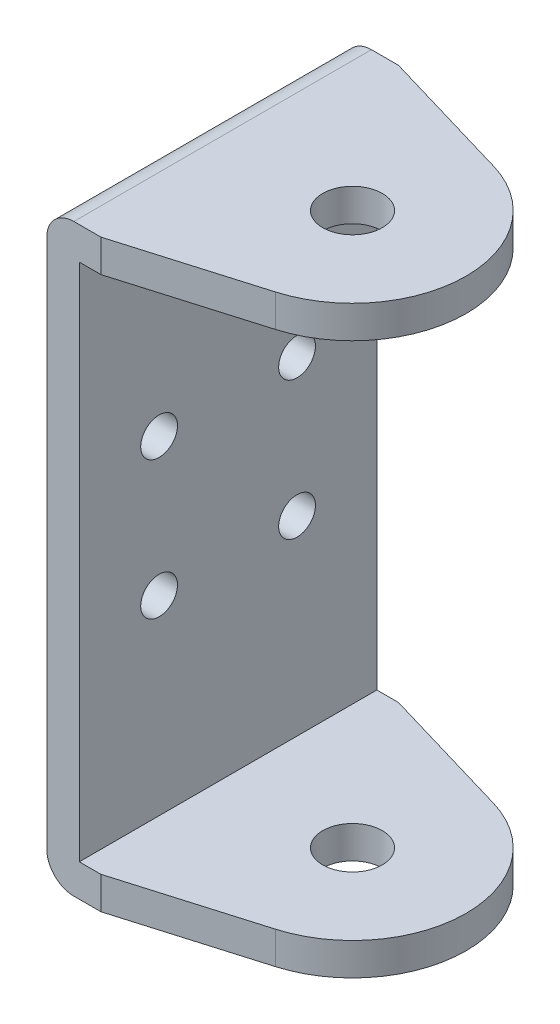
ISO-10303-21;
HEADER;
FILE_DESCRIPTION(('STEP AP214'),'2;1');
FILE_NAME('part.step','',(''),(''),'','','');
FILE_SCHEMA(('AUTOMOTIVE_DESIGN { 1 0 10303 214 1 1 1 1 }'));
ENDSEC;
DATA;
#1=APPLICATION_CONTEXT('core data for automotive mechanical design processes');
#2=APPLICATION_PROTOCOL_DEFINITION('international standard','automotive_design',2000,#1);
#3=PRODUCT_CONTEXT('',#1,'mechanical');
#4=PRODUCT('Part','Part','',(#3));
#5=PRODUCT_RELATED_PRODUCT_CATEGORY('part','',(#4));
#6=PRODUCT_DEFINITION_FORMATION('','',#4);
#7=PRODUCT_DEFINITION_CONTEXT('part definition',#1,'design');
#8=PRODUCT_DEFINITION('design','',#6,#7);
#9=PRODUCT_DEFINITION_SHAPE('','',#8);
#10=(LENGTH_UNIT() NAMED_UNIT(*) SI_UNIT(.MILLI.,.METRE.));
#11=(NAMED_UNIT(*) PLANE_ANGLE_UNIT() SI_UNIT($,.RADIAN.));
#12=(NAMED_UNIT(*) SI_UNIT($,.STERADIAN.) SOLID_ANGLE_UNIT());
#13=UNCERTAINTY_MEASURE_WITH_UNIT(LENGTH_MEASURE(1.E-05),#10,'distance_accuracy_value','');
#14=(GEOMETRIC_REPRESENTATION_CONTEXT(3) GLOBAL_UNCERTAINTY_ASSIGNED_CONTEXT((#13)) GLOBAL_UNIT_ASSIGNED_CONTEXT((#10,
#11,#12)) REPRESENTATION_CONTEXT('',''));
#15=CARTESIAN_POINT('',(0.,0.,0.));
#16=DIRECTION('',(0.,0.,1.));
#17=DIRECTION('',(1.,0.,0.));
#18=AXIS2_PLACEMENT_3D('',#15,#16,#17);
#19=CARTESIAN_POINT('',(-44.,48.,27.5));
#20=DIRECTION('',(-1.,0.,0.));
#21=DIRECTION('',(0.,-1.,0.));
#22=AXIS2_PLACEMENT_3D('',#19,#20,#21);
#23=PLANE('',#22);
#24=CARTESIAN_POINT('',(-44.,-12.75,12.75));
#25=DIRECTION('',(-1.,0.,0.));
#26=DIRECTION('',(0.,-1.,0.));
#27=AXIS2_PLACEMENT_3D('',#24,#25,#26);
#28=CIRCLE('',#27,3.4);
#29=CARTESIAN_POINT('',(-44.,-16.15,12.75));
#30=VERTEX_POINT('',#29);
#31=EDGE_CURVE('E210',#30,#30,#28,.T.);
#32=ORIENTED_EDGE('',*,*,#31,.T.);
#33=EDGE_LOOP('',(#32));
#34=FACE_BOUND('',#33,.T.);
#35=CARTESIAN_POINT('',(-44.,-12.75,-12.75));
#36=DIRECTION('',(-1.,0.,0.));
#37=DIRECTION('',(0.,-1.,0.));
#38=AXIS2_PLACEMENT_3D('',#35,#36,#37);
#39=CIRCLE('',#38,3.4);
#40=CARTESIAN_POINT('',(-44.,-16.15,-12.75));
#41=VERTEX_POINT('',#40);
#42=EDGE_CURVE('E216',#41,#41,#39,.T.);
#43=ORIENTED_EDGE('',*,*,#42,.T.);
#44=EDGE_LOOP('',(#43));
#45=FACE_BOUND('',#44,.T.);
#46=CARTESIAN_POINT('',(-44.,12.75,-12.75));
#47=DIRECTION('',(-1.,0.,0.));
#48=DIRECTION('',(0.,-1.,0.));
#49=AXIS2_PLACEMENT_3D('',#46,#47,#48);
#50=CIRCLE('',#49,3.4);
#51=CARTESIAN_POINT('',(-44.,9.34999999999999,-12.75));
#52=VERTEX_POINT('',#51);
#53=EDGE_CURVE('E222',#52,#52,#50,.T.);
#54=ORIENTED_EDGE('',*,*,#53,.T.);
#55=EDGE_LOOP('',(#54));
#56=FACE_BOUND('',#55,.T.);
#57=CARTESIAN_POINT('',(-44.,12.75,12.75));
#58=DIRECTION('',(-1.,0.,0.));
#59=DIRECTION('',(0.,-1.,0.));
#60=AXIS2_PLACEMENT_3D('',#57,#58,#59);
#61=CIRCLE('',#60,3.4);
#62=CARTESIAN_POINT('',(-44.,9.35,12.75));
#63=VERTEX_POINT('',#62);
#64=EDGE_CURVE('E228',#63,#63,#61,.T.);
#65=ORIENTED_EDGE('',*,*,#64,.T.);
#66=EDGE_LOOP('',(#65));
#67=FACE_BOUND('',#66,.T.);
#68=DIRECTION('',(0.,1.,0.));
#69=VECTOR('',#68,1.);
#70=CARTESIAN_POINT('',(-44.,48.,-27.5));
#71=LINE('',#70,#69);
#72=CARTESIAN_POINT('',(-44.,-48.,-27.5));
#73=VERTEX_POINT('',#72);
#74=CARTESIAN_POINT('',(-44.,48.,-27.5));
#75=VERTEX_POINT('',#74);
#76=EDGE_CURVE('E231',#73,#75,#71,.T.);
#77=ORIENTED_EDGE('',*,*,#76,.T.);
#78=DIRECTION('',(0.,0.,-1.));
#79=VECTOR('',#78,1.);
#80=CARTESIAN_POINT('',(-44.,48.,27.5));
#81=LINE('',#80,#79);
#82=CARTESIAN_POINT('',(-44.,48.,27.5));
#83=VERTEX_POINT('',#82);
#84=EDGE_CURVE('E157',#83,#75,#81,.T.);
#85=ORIENTED_EDGE('',*,*,#84,.F.);
#86=DIRECTION('',(0.,1.,0.));
#87=VECTOR('',#86,1.);
#88=CARTESIAN_POINT('',(-44.,48.,27.5));
#89=LINE('',#88,#87);
#90=CARTESIAN_POINT('',(-44.,-48.,27.5));
#91=VERTEX_POINT('',#90);
#92=EDGE_CURVE('E232',#91,#83,#89,.T.);
#93=ORIENTED_EDGE('',*,*,#92,.F.);
#94=DIRECTION('',(0.,0.,-1.));
#95=VECTOR('',#94,1.);
#96=CARTESIAN_POINT('',(-44.,-48.,27.5));
#97=LINE('',#96,#95);
#98=EDGE_CURVE('E187',#91,#73,#97,.T.);
#99=ORIENTED_EDGE('',*,*,#98,.T.);
#100=EDGE_LOOP('',(#77,#85,#93,#99));
#101=FACE_BOUND('',#100,.T.);
#102=ADVANCED_FACE('F35',(#34,#45,#56,#67,#101),#23,.F.);
#103=CARTESIAN_POINT('',(0.,48.,27.5));
#104=DIRECTION('',(0.,1.,0.));
#105=DIRECTION('',(-1.,0.,0.));
#106=AXIS2_PLACEMENT_3D('',#103,#104,#105);
#107=PLANE('',#106);
#108=CARTESIAN_POINT('',(-21.,48.,0.));
#109=DIRECTION('',(0.,1.,0.));
#110=DIRECTION('',(-1.,0.,0.));
#111=AXIS2_PLACEMENT_3D('',#108,#109,#110);
#112=CIRCLE('',#111,5.5);
#113=CARTESIAN_POINT('',(-26.5,48.,0.));
#114=VERTEX_POINT('',#113);
#115=EDGE_CURVE('E283',#114,#114,#112,.T.);
#116=ORIENTED_EDGE('',*,*,#115,.T.);
#117=EDGE_LOOP('',(#116));
#118=FACE_BOUND('',#117,.T.);
#119=DIRECTION('',(1.,0.,0.));
#120=VECTOR('',#119,1.);
#121=CARTESIAN_POINT('',(0.,48.,-27.5));
#122=LINE('',#121,#120);
#123=CARTESIAN_POINT('',(-40.,48.,-27.5));
#124=VERTEX_POINT('',#123);
#125=EDGE_CURVE('E143',#75,#124,#122,.T.);
#126=ORIENTED_EDGE('',*,*,#125,.T.);
#127=DIRECTION('',(0.95913299414629,0.,0.282955649422261));
#128=VECTOR('',#127,1.);
#129=CARTESIAN_POINT('',(11.724009476655,48.,-12.2408015556622));
#130=LINE('',#129,#128);
#131=CARTESIAN_POINT('',(-15.0579313621325,48.,-20.1417928770721));
#132=VERTEX_POINT('',#131);
#133=EDGE_CURVE('E50',#124,#132,#130,.T.);
#134=ORIENTED_EDGE('',*,*,#133,.T.);
#135=CARTESIAN_POINT('',(-21.,48.,0.));
#136=DIRECTION('',(0.,1.,0.));
#137=DIRECTION('',(-1.,0.,0.));
#138=AXIS2_PLACEMENT_3D('',#135,#136,#137);
#139=CIRCLE('',#138,21.);
#140=CARTESIAN_POINT('',(-15.0579313621325,48.,20.1417928770721));
#141=VERTEX_POINT('',#140);
#142=EDGE_CURVE('E54',#132,#141,#139,.F.);
#143=ORIENTED_EDGE('',*,*,#142,.T.);
#144=DIRECTION('',(-0.95913299414629,0.,0.282955649422261));
#145=VECTOR('',#144,1.);
#146=CARTESIAN_POINT('',(-3.20255598159894,48.,16.6443160303607));
#147=LINE('',#146,#145);
#148=CARTESIAN_POINT('',(-40.,48.,27.5));
#149=VERTEX_POINT('',#148);
#150=EDGE_CURVE('E201',#141,#149,#147,.T.);
#151=ORIENTED_EDGE('',*,*,#150,.T.);
#152=DIRECTION('',(1.,0.,0.));
#153=VECTOR('',#152,1.);
#154=CARTESIAN_POINT('',(0.,48.,27.5));
#155=LINE('',#154,#153);
#156=EDGE_CURVE('E234',#83,#149,#155,.T.);
#157=ORIENTED_EDGE('',*,*,#156,.F.);
#158=ORIENTED_EDGE('',*,*,#84,.T.);
#159=EDGE_LOOP('',(#126,#134,#143,#151,#157,#158));
#160=FACE_BOUND('',#159,.T.);
#161=ADVANCED_FACE('F304',(#118,#160),#107,.F.);
#162=CARTESIAN_POINT('',(0.,54.,27.5));
#163=DIRECTION('',(0.,-1.,0.));
#164=DIRECTION('',(1.,0.,0.));
#165=AXIS2_PLACEMENT_3D('',#162,#163,#164);
#166=PLANE('',#165);
#167=CARTESIAN_POINT('',(-21.,54.,0.));
#168=DIRECTION('',(0.,1.,0.));
#169=DIRECTION('',(-1.,0.,0.));
#170=AXIS2_PLACEMENT_3D('',#167,#168,#169);
#171=CIRCLE('',#170,5.5);
#172=CARTESIAN_POINT('',(-26.5,54.,0.));
#173=VERTEX_POINT('',#172);
#174=EDGE_CURVE('E370',#173,#173,#171,.T.);
#175=ORIENTED_EDGE('',*,*,#174,.F.);
#176=EDGE_LOOP('',(#175));
#177=FACE_BOUND('',#176,.T.);
#178=CARTESIAN_POINT('',(-21.,54.,0.));
#179=DIRECTION('',(0.,-1.,0.));
#180=DIRECTION('',(1.,0.,0.));
#181=AXIS2_PLACEMENT_3D('',#178,#179,#180);
#182=CIRCLE('',#181,21.);
#183=CARTESIAN_POINT('',(-15.0579313621325,54.,20.1417928770721));
#184=VERTEX_POINT('',#183);
#185=CARTESIAN_POINT('',(-15.0579313621325,54.,-20.1417928770721));
#186=VERTEX_POINT('',#185);
#187=EDGE_CURVE('E149',#184,#186,#182,.F.);
#188=ORIENTED_EDGE('',*,*,#187,.T.);
#189=DIRECTION('',(-0.95913299414629,0.,-0.282955649422261));
#190=VECTOR('',#189,1.);
#191=CARTESIAN_POINT('',(11.724009476655,54.,-12.2408015556622));
#192=LINE('',#191,#190);
#193=CARTESIAN_POINT('',(-40.,54.,-27.5));
#194=VERTEX_POINT('',#193);
#195=EDGE_CURVE('E146',#186,#194,#192,.T.);
#196=ORIENTED_EDGE('',*,*,#195,.T.);
#197=DIRECTION('',(-1.,0.,0.));
#198=VECTOR('',#197,1.);
#199=CARTESIAN_POINT('',(0.,54.,-27.5));
#200=LINE('',#199,#198);
#201=CARTESIAN_POINT('',(-45.,54.,-27.5));
#202=VERTEX_POINT('',#201);
#203=EDGE_CURVE('E133',#194,#202,#200,.T.);
#204=ORIENTED_EDGE('',*,*,#203,.T.);
#205=DIRECTION('',(0.,0.,-1.));
#206=VECTOR('',#205,1.);
#207=CARTESIAN_POINT('',(-45.,54.,27.5));
#208=LINE('',#207,#206);
#209=CARTESIAN_POINT('',(-45.,54.,27.5));
#210=VERTEX_POINT('',#209);
#211=EDGE_CURVE('E162',#210,#202,#208,.T.);
#212=ORIENTED_EDGE('',*,*,#211,.F.);
#213=DIRECTION('',(-1.,0.,0.));
#214=VECTOR('',#213,1.);
#215=CARTESIAN_POINT('',(0.,54.,27.5));
#216=LINE('',#215,#214);
#217=CARTESIAN_POINT('',(-40.,54.,27.5));
#218=VERTEX_POINT('',#217);
#219=EDGE_CURVE('E237',#218,#210,#216,.T.);
#220=ORIENTED_EDGE('',*,*,#219,.F.);
#221=DIRECTION('',(0.95913299414629,0.,-0.282955649422261));
#222=VECTOR('',#221,1.);
#223=CARTESIAN_POINT('',(-3.20255598159894,54.,16.6443160303607));
#224=LINE('',#223,#222);
#225=EDGE_CURVE('E196',#218,#184,#224,.T.);
#226=ORIENTED_EDGE('',*,*,#225,.T.);
#227=EDGE_LOOP('',(#188,#196,#204,#212,#220,#226));
#228=FACE_BOUND('',#227,.T.);
#229=ADVANCED_FACE('F147',(#177,#228),#166,.F.);
#230=CARTESIAN_POINT('',(-45.,49.,27.5));
#231=DIRECTION('',(0.,0.,-1.));
#232=DIRECTION('',(-1.,0.,0.));
#233=AXIS2_PLACEMENT_3D('',#230,#231,#232);
#234=CYLINDRICAL_SURFACE('',#233,5.);
#235=CARTESIAN_POINT('',(-45.,49.,-27.5));
#236=DIRECTION('',(0.,0.,1.));
#237=DIRECTION('',(-1.,0.,0.));
#238=AXIS2_PLACEMENT_3D('',#235,#236,#237);
#239=CIRCLE('',#238,5.);
#240=CARTESIAN_POINT('',(-50.,49.,-27.5));
#241=VERTEX_POINT('',#240);
#242=EDGE_CURVE('E139',#202,#241,#239,.T.);
#243=ORIENTED_EDGE('',*,*,#242,.T.);
#244=DIRECTION('',(0.,0.,-1.));
#245=VECTOR('',#244,1.);
#246=CARTESIAN_POINT('',(-50.,49.,27.5));
#247=LINE('',#246,#245);
#248=CARTESIAN_POINT('',(-50.,49.,27.5));
#249=VERTEX_POINT('',#248);
#250=EDGE_CURVE('E265',#249,#241,#247,.T.);
#251=ORIENTED_EDGE('',*,*,#250,.F.);
#252=CARTESIAN_POINT('',(-45.,49.,27.5));
#253=DIRECTION('',(0.,0.,1.));
#254=DIRECTION('',(-1.,0.,0.));
#255=AXIS2_PLACEMENT_3D('',#252,#253,#254);
#256=CIRCLE('',#255,5.);
#257=EDGE_CURVE('E239',#210,#249,#256,.T.);
#258=ORIENTED_EDGE('',*,*,#257,.F.);
#259=ORIENTED_EDGE('',*,*,#211,.T.);
#260=EDGE_LOOP('',(#243,#251,#258,#259));
#261=FACE_BOUND('',#260,.T.);
#262=ADVANCED_FACE('F269',(#261),#234,.T.);
#263=CARTESIAN_POINT('',(-50.,49.,27.5));
#264=DIRECTION('',(1.,0.,0.));
#265=DIRECTION('',(0.,1.,0.));
#266=AXIS2_PLACEMENT_3D('',#263,#264,#265);
#267=PLANE('',#266);
#268=CARTESIAN_POINT('',(-50.,-12.75,12.75));
#269=DIRECTION('',(-1.,0.,0.));
#270=DIRECTION('',(0.,1.,0.));
#271=AXIS2_PLACEMENT_3D('',#268,#269,#270);
#272=CIRCLE('',#271,3.4);
#273=CARTESIAN_POINT('',(-50.,-9.35000000000001,12.75));
#274=VERTEX_POINT('',#273);
#275=EDGE_CURVE('E207',#274,#274,#272,.T.);
#276=ORIENTED_EDGE('',*,*,#275,.F.);
#277=EDGE_LOOP('',(#276));
#278=FACE_BOUND('',#277,.T.);
#279=CARTESIAN_POINT('',(-50.,-12.75,-12.75));
#280=DIRECTION('',(-1.,0.,0.));
#281=DIRECTION('',(0.,1.,0.));
#282=AXIS2_PLACEMENT_3D('',#279,#280,#281);
#283=CIRCLE('',#282,3.4);
#284=CARTESIAN_POINT('',(-50.,-9.35000000000001,-12.75));
#285=VERTEX_POINT('',#284);
#286=EDGE_CURVE('E213',#285,#285,#283,.T.);
#287=ORIENTED_EDGE('',*,*,#286,.F.);
#288=EDGE_LOOP('',(#287));
#289=FACE_BOUND('',#288,.T.);
#290=CARTESIAN_POINT('',(-50.,12.75,-12.75));
#291=DIRECTION('',(-1.,0.,0.));
#292=DIRECTION('',(0.,-1.,0.));
#293=AXIS2_PLACEMENT_3D('',#290,#291,#292);
#294=CIRCLE('',#293,3.4);
#295=CARTESIAN_POINT('',(-50.,9.34999999999999,-12.75));
#296=VERTEX_POINT('',#295);
#297=EDGE_CURVE('E219',#296,#296,#294,.T.);
#298=ORIENTED_EDGE('',*,*,#297,.F.);
#299=EDGE_LOOP('',(#298));
#300=FACE_BOUND('',#299,.T.);
#301=CARTESIAN_POINT('',(-50.,12.75,12.75));
#302=DIRECTION('',(-1.,0.,0.));
#303=DIRECTION('',(0.,-1.,0.));
#304=AXIS2_PLACEMENT_3D('',#301,#302,#303);
#305=CIRCLE('',#304,3.4);
#306=CARTESIAN_POINT('',(-50.,9.35,12.75));
#307=VERTEX_POINT('',#306);
#308=EDGE_CURVE('E225',#307,#307,#305,.T.);
#309=ORIENTED_EDGE('',*,*,#308,.F.);
#310=EDGE_LOOP('',(#309));
#311=FACE_BOUND('',#310,.T.);
#312=DIRECTION('',(0.,-1.,0.));
#313=VECTOR('',#312,1.);
#314=CARTESIAN_POINT('',(-50.,49.,-27.5));
#315=LINE('',#314,#313);
#316=CARTESIAN_POINT('',(-50.,-49.,-27.5));
#317=VERTEX_POINT('',#316);
#318=EDGE_CURVE('E250',#241,#317,#315,.T.);
#319=ORIENTED_EDGE('',*,*,#318,.T.);
#320=DIRECTION('',(0.,0.,-1.));
#321=VECTOR('',#320,1.);
#322=CARTESIAN_POINT('',(-50.,-49.,27.5));
#323=LINE('',#322,#321);
#324=CARTESIAN_POINT('',(-50.,-49.,27.5));
#325=VERTEX_POINT('',#324);
#326=EDGE_CURVE('E262',#325,#317,#323,.T.);
#327=ORIENTED_EDGE('',*,*,#326,.F.);
#328=DIRECTION('',(0.,-1.,0.));
#329=VECTOR('',#328,1.);
#330=CARTESIAN_POINT('',(-50.,49.,27.5));
#331=LINE('',#330,#329);
#332=EDGE_CURVE('E241',#249,#325,#331,.T.);
#333=ORIENTED_EDGE('',*,*,#332,.F.);
#334=ORIENTED_EDGE('',*,*,#250,.T.);
#335=EDGE_LOOP('',(#319,#327,#333,#334));
#336=FACE_BOUND('',#335,.T.);
#337=ADVANCED_FACE('F318',(#278,#289,#300,#311,#336),#267,.F.);
#338=CARTESIAN_POINT('',(-45.,-49.,27.5));
#339=DIRECTION('',(0.,0.,-1.));
#340=DIRECTION('',(-1.,0.,0.));
#341=AXIS2_PLACEMENT_3D('',#338,#339,#340);
#342=CYLINDRICAL_SURFACE('',#341,5.);
#343=CARTESIAN_POINT('',(-45.,-49.,-27.5));
#344=DIRECTION('',(0.,0.,1.));
#345=DIRECTION('',(-1.,0.,0.));
#346=AXIS2_PLACEMENT_3D('',#343,#344,#345);
#347=CIRCLE('',#346,5.);
#348=CARTESIAN_POINT('',(-45.,-54.,-27.5));
#349=VERTEX_POINT('',#348);
#350=EDGE_CURVE('E252',#317,#349,#347,.T.);
#351=ORIENTED_EDGE('',*,*,#350,.T.);
#352=DIRECTION('',(0.,0.,-1.));
#353=VECTOR('',#352,1.);
#354=CARTESIAN_POINT('',(-45.,-54.,27.5));
#355=LINE('',#354,#353);
#356=CARTESIAN_POINT('',(-45.,-54.,27.5));
#357=VERTEX_POINT('',#356);
#358=EDGE_CURVE('E259',#357,#349,#355,.T.);
#359=ORIENTED_EDGE('',*,*,#358,.F.);
#360=CARTESIAN_POINT('',(-45.,-49.,27.5));
#361=DIRECTION('',(0.,0.,1.));
#362=DIRECTION('',(-1.,0.,0.));
#363=AXIS2_PLACEMENT_3D('',#360,#361,#362);
#364=CIRCLE('',#363,5.);
#365=EDGE_CURVE('E243',#325,#357,#364,.T.);
#366=ORIENTED_EDGE('',*,*,#365,.F.);
#367=ORIENTED_EDGE('',*,*,#326,.T.);
#368=EDGE_LOOP('',(#351,#359,#366,#367));
#369=FACE_BOUND('',#368,.T.);
#370=ADVANCED_FACE('F321',(#369),#342,.T.);
#371=CARTESIAN_POINT('',(0.,-54.,27.5));
#372=DIRECTION('',(0.,1.,0.));
#373=DIRECTION('',(-1.,0.,0.));
#374=AXIS2_PLACEMENT_3D('',#371,#372,#373);
#375=PLANE('',#374);
#376=CARTESIAN_POINT('',(-21.,-54.,0.));
#377=DIRECTION('',(0.,1.,0.));
#378=DIRECTION('',(-1.,0.,0.));
#379=AXIS2_PLACEMENT_3D('',#376,#377,#378);
#380=CIRCLE('',#379,5.5);
#381=CARTESIAN_POINT('',(-26.5,-54.,0.));
#382=VERTEX_POINT('',#381);
#383=EDGE_CURVE('E373',#382,#382,#380,.F.);
#384=ORIENTED_EDGE('',*,*,#383,.F.);
#385=EDGE_LOOP('',(#384));
#386=FACE_BOUND('',#385,.T.);
#387=DIRECTION('',(1.,0.,0.));
#388=VECTOR('',#387,1.);
#389=CARTESIAN_POINT('',(0.,-54.,-27.5));
#390=LINE('',#389,#388);
#391=CARTESIAN_POINT('',(-40.,-54.,-27.5));
#392=VERTEX_POINT('',#391);
#393=EDGE_CURVE('E254',#349,#392,#390,.T.);
#394=ORIENTED_EDGE('',*,*,#393,.T.);
#395=DIRECTION('',(0.95913299414629,0.,0.282955649422261));
#396=VECTOR('',#395,1.);
#397=CARTESIAN_POINT('',(11.724009476655,-54.,-12.2408015556622));
#398=LINE('',#397,#396);
#399=CARTESIAN_POINT('',(-15.0579313621325,-54.,-20.1417928770721));
#400=VERTEX_POINT('',#399);
#401=EDGE_CURVE('E153',#392,#400,#398,.T.);
#402=ORIENTED_EDGE('',*,*,#401,.T.);
#403=CARTESIAN_POINT('',(-21.,-54.,0.));
#404=DIRECTION('',(0.,1.,0.));
#405=DIRECTION('',(-1.,0.,0.));
#406=AXIS2_PLACEMENT_3D('',#403,#404,#405);
#407=CIRCLE('',#406,21.);
#408=CARTESIAN_POINT('',(-15.0579313621325,-54.,20.1417928770721));
#409=VERTEX_POINT('',#408);
#410=EDGE_CURVE('E203',#400,#409,#407,.F.);
#411=ORIENTED_EDGE('',*,*,#410,.T.);
#412=DIRECTION('',(-0.95913299414629,0.,0.282955649422261));
#413=VECTOR('',#412,1.);
#414=CARTESIAN_POINT('',(-3.20255598159893,-54.,16.6443160303608));
#415=LINE('',#414,#413);
#416=CARTESIAN_POINT('',(-40.,-54.,27.5));
#417=VERTEX_POINT('',#416);
#418=EDGE_CURVE('E194',#409,#417,#415,.T.);
#419=ORIENTED_EDGE('',*,*,#418,.T.);
#420=DIRECTION('',(1.,0.,0.));
#421=VECTOR('',#420,1.);
#422=CARTESIAN_POINT('',(0.,-54.,27.5));
#423=LINE('',#422,#421);
#424=EDGE_CURVE('E178',#357,#417,#423,.T.);
#425=ORIENTED_EDGE('',*,*,#424,.F.);
#426=ORIENTED_EDGE('',*,*,#358,.T.);
#427=EDGE_LOOP('',(#394,#402,#411,#419,#425,#426));
#428=FACE_BOUND('',#427,.T.);
#429=ADVANCED_FACE('F293',(#386,#428),#375,.F.);
#430=CARTESIAN_POINT('',(0.,-48.,27.5));
#431=DIRECTION('',(0.,-1.,0.));
#432=DIRECTION('',(1.,0.,0.));
#433=AXIS2_PLACEMENT_3D('',#430,#431,#432);
#434=PLANE('',#433);
#435=CARTESIAN_POINT('',(-21.,-48.,0.));
#436=DIRECTION('',(0.,-1.,0.));
#437=DIRECTION('',(1.,0.,0.));
#438=AXIS2_PLACEMENT_3D('',#435,#436,#437);
#439=CIRCLE('',#438,5.5);
#440=CARTESIAN_POINT('',(-15.5,-48.,0.));
#441=VERTEX_POINT('',#440);
#442=EDGE_CURVE('E38',#441,#441,#439,.T.);
#443=ORIENTED_EDGE('',*,*,#442,.T.);
#444=EDGE_LOOP('',(#443));
#445=FACE_BOUND('',#444,.T.);
#446=CARTESIAN_POINT('',(-21.,-48.,0.));
#447=DIRECTION('',(0.,-1.,0.));
#448=DIRECTION('',(1.,0.,0.));
#449=AXIS2_PLACEMENT_3D('',#446,#447,#448);
#450=CIRCLE('',#449,21.);
#451=CARTESIAN_POINT('',(-15.0579313621325,-48.,20.1417928770721));
#452=VERTEX_POINT('',#451);
#453=CARTESIAN_POINT('',(-15.0579313621325,-48.,-20.1417928770721));
#454=VERTEX_POINT('',#453);
#455=EDGE_CURVE('E11',#452,#454,#450,.F.);
#456=ORIENTED_EDGE('',*,*,#455,.T.);
#457=DIRECTION('',(-0.95913299414629,0.,-0.282955649422261));
#458=VECTOR('',#457,1.);
#459=CARTESIAN_POINT('',(11.724009476655,-48.,-12.2408015556622));
#460=LINE('',#459,#458);
#461=CARTESIAN_POINT('',(-40.,-48.,-27.5));
#462=VERTEX_POINT('',#461);
#463=EDGE_CURVE('E287',#454,#462,#460,.T.);
#464=ORIENTED_EDGE('',*,*,#463,.T.);
#465=DIRECTION('',(-1.,0.,0.));
#466=VECTOR('',#465,1.);
#467=CARTESIAN_POINT('',(0.,-48.,-27.5));
#468=LINE('',#467,#466);
#469=EDGE_CURVE('E235',#462,#73,#468,.T.);
#470=ORIENTED_EDGE('',*,*,#469,.T.);
#471=ORIENTED_EDGE('',*,*,#98,.F.);
#472=DIRECTION('',(-1.,0.,0.));
#473=VECTOR('',#472,1.);
#474=CARTESIAN_POINT('',(0.,-48.,27.5));
#475=LINE('',#474,#473);
#476=CARTESIAN_POINT('',(-40.,-48.,27.5));
#477=VERTEX_POINT('',#476);
#478=EDGE_CURVE('E175',#477,#91,#475,.T.);
#479=ORIENTED_EDGE('',*,*,#478,.F.);
#480=DIRECTION('',(0.95913299414629,0.,-0.282955649422261));
#481=VECTOR('',#480,1.);
#482=CARTESIAN_POINT('',(-3.20255598159893,-48.,16.6443160303608));
#483=LINE('',#482,#481);
#484=EDGE_CURVE('E184',#477,#452,#483,.T.);
#485=ORIENTED_EDGE('',*,*,#484,.T.);
#486=EDGE_LOOP('',(#456,#464,#470,#471,#479,#485));
#487=FACE_BOUND('',#486,.T.);
#488=ADVANCED_FACE('F183',(#445,#487),#434,.F.);
#489=CARTESIAN_POINT('',(-45.,-49.,27.5));
#490=DIRECTION('',(0.,0.,-1.));
#491=DIRECTION('',(-1.,0.,0.));
#492=AXIS2_PLACEMENT_3D('',#489,#490,#491);
#493=PLANE('',#492);
#494=ORIENTED_EDGE('',*,*,#424,.T.);
#495=DIRECTION('',(0.,1.,0.));
#496=VECTOR('',#495,1.);
#497=CARTESIAN_POINT('',(-40.,-49.,27.5));
#498=LINE('',#497,#496);
#499=EDGE_CURVE('E43',#417,#477,#498,.T.);
#500=ORIENTED_EDGE('',*,*,#499,.T.);
#501=ORIENTED_EDGE('',*,*,#478,.T.);
#502=ORIENTED_EDGE('',*,*,#92,.T.);
#503=ORIENTED_EDGE('',*,*,#156,.T.);
#504=EDGE_CURVE('E160',#149,#218,#498,.T.);
#505=ORIENTED_EDGE('',*,*,#504,.T.);
#506=ORIENTED_EDGE('',*,*,#219,.T.);
#507=ORIENTED_EDGE('',*,*,#257,.T.);
#508=ORIENTED_EDGE('',*,*,#332,.T.);
#509=ORIENTED_EDGE('',*,*,#365,.T.);
#510=EDGE_LOOP('',(#494,#500,#501,#502,#503,#505,#506,#507,#508,#509));
#511=FACE_BOUND('',#510,.T.);
#512=ADVANCED_FACE('F173',(#511),#493,.F.);
#513=CARTESIAN_POINT('',(-45.,-49.,-27.5));
#514=DIRECTION('',(0.,0.,-1.));
#515=DIRECTION('',(-1.,0.,0.));
#516=AXIS2_PLACEMENT_3D('',#513,#514,#515);
#517=PLANE('',#516);
#518=DIRECTION('',(0.,1.,0.));
#519=VECTOR('',#518,1.);
#520=CARTESIAN_POINT('',(-40.,-49.,-27.5));
#521=LINE('',#520,#519);
#522=EDGE_CURVE('E156',#392,#462,#521,.T.);
#523=ORIENTED_EDGE('',*,*,#522,.F.);
#524=ORIENTED_EDGE('',*,*,#393,.F.);
#525=ORIENTED_EDGE('',*,*,#350,.F.);
#526=ORIENTED_EDGE('',*,*,#318,.F.);
#527=ORIENTED_EDGE('',*,*,#242,.F.);
#528=ORIENTED_EDGE('',*,*,#203,.F.);
#529=EDGE_CURVE('E137',#124,#194,#521,.T.);
#530=ORIENTED_EDGE('',*,*,#529,.F.);
#531=ORIENTED_EDGE('',*,*,#125,.F.);
#532=ORIENTED_EDGE('',*,*,#76,.F.);
#533=ORIENTED_EDGE('',*,*,#469,.F.);
#534=EDGE_LOOP('',(#523,#524,#525,#526,#527,#528,#530,#531,#532,#533));
#535=FACE_BOUND('',#534,.T.);
#536=ADVANCED_FACE('F135',(#535),#517,.T.);
#537=CARTESIAN_POINT('',(-40.,12.75,12.75));
#538=DIRECTION('',(-1.,0.,0.));
#539=DIRECTION('',(0.,-1.,0.));
#540=AXIS2_PLACEMENT_3D('',#537,#538,#539);
#541=CYLINDRICAL_SURFACE('',#540,3.4);
#542=ORIENTED_EDGE('',*,*,#308,.T.);
#543=EDGE_LOOP('',(#542));
#544=FACE_BOUND('',#543,.T.);
#545=ORIENTED_EDGE('',*,*,#64,.F.);
#546=EDGE_LOOP('',(#545));
#547=FACE_BOUND('',#546,.T.);
#548=ADVANCED_FACE('F334',(#544,#547),#541,.F.);
#549=CARTESIAN_POINT('',(-40.,12.75,-12.75));
#550=DIRECTION('',(-1.,0.,0.));
#551=DIRECTION('',(0.,-1.,0.));
#552=AXIS2_PLACEMENT_3D('',#549,#550,#551);
#553=CYLINDRICAL_SURFACE('',#552,3.4);
#554=ORIENTED_EDGE('',*,*,#297,.T.);
#555=EDGE_LOOP('',(#554));
#556=FACE_BOUND('',#555,.T.);
#557=ORIENTED_EDGE('',*,*,#53,.F.);
#558=EDGE_LOOP('',(#557));
#559=FACE_BOUND('',#558,.T.);
#560=ADVANCED_FACE('F339',(#556,#559),#553,.F.);
#561=CARTESIAN_POINT('',(-40.,-12.75,-12.75));
#562=DIRECTION('',(-1.,0.,0.));
#563=DIRECTION('',(0.,-1.,0.));
#564=AXIS2_PLACEMENT_3D('',#561,#562,#563);
#565=CYLINDRICAL_SURFACE('',#564,3.4);
#566=ORIENTED_EDGE('',*,*,#286,.T.);
#567=EDGE_LOOP('',(#566));
#568=FACE_BOUND('',#567,.T.);
#569=ORIENTED_EDGE('',*,*,#42,.F.);
#570=EDGE_LOOP('',(#569));
#571=FACE_BOUND('',#570,.T.);
#572=ADVANCED_FACE('F343',(#568,#571),#565,.F.);
#573=CARTESIAN_POINT('',(-40.,-12.75,12.75));
#574=DIRECTION('',(-1.,0.,0.));
#575=DIRECTION('',(0.,-1.,0.));
#576=AXIS2_PLACEMENT_3D('',#573,#574,#575);
#577=CYLINDRICAL_SURFACE('',#576,3.4);
#578=ORIENTED_EDGE('',*,*,#275,.T.);
#579=EDGE_LOOP('',(#578));
#580=FACE_BOUND('',#579,.T.);
#581=ORIENTED_EDGE('',*,*,#31,.F.);
#582=EDGE_LOOP('',(#581));
#583=FACE_BOUND('',#582,.T.);
#584=ADVANCED_FACE('F347',(#580,#583),#577,.F.);
#585=CARTESIAN_POINT('',(-40.,225.383533339991,27.5));
#586=DIRECTION('',(-0.282955649422261,0.,-0.95913299414629));
#587=DIRECTION('',(-0.95913299414629,0.,0.282955649422261));
#588=AXIS2_PLACEMENT_3D('',#585,#586,#587);
#589=PLANE('',#588);
#590=ORIENTED_EDGE('',*,*,#150,.F.);
#591=DIRECTION('',(0.,-1.,0.));
#592=VECTOR('',#591,1.);
#593=CARTESIAN_POINT('',(-15.0579313621326,225.383533339991,20.1417928770721));
#594=LINE('',#593,#592);
#595=EDGE_CURVE('E276',#184,#141,#594,.T.);
#596=ORIENTED_EDGE('',*,*,#595,.F.);
#597=ORIENTED_EDGE('',*,*,#225,.F.);
#598=ORIENTED_EDGE('',*,*,#504,.F.);
#599=EDGE_LOOP('',(#590,#596,#597,#598));
#600=FACE_BOUND('',#599,.T.);
#601=ADVANCED_FACE('F274',(#600),#589,.F.);
#602=CARTESIAN_POINT('',(-40.,225.383533339991,-27.5));
#603=DIRECTION('',(-0.282955649422261,0.,0.95913299414629));
#604=DIRECTION('',(0.95913299414629,0.,0.282955649422261));
#605=AXIS2_PLACEMENT_3D('',#602,#603,#604);
#606=PLANE('',#605);
#607=ORIENTED_EDGE('',*,*,#133,.F.);
#608=ORIENTED_EDGE('',*,*,#529,.T.);
#609=ORIENTED_EDGE('',*,*,#195,.F.);
#610=DIRECTION('',(0.,-1.,0.));
#611=VECTOR('',#610,1.);
#612=CARTESIAN_POINT('',(-15.0579313621326,225.383533339991,-20.1417928770721));
#613=LINE('',#612,#611);
#614=EDGE_CURVE('E281',#186,#132,#613,.T.);
#615=ORIENTED_EDGE('',*,*,#614,.T.);
#616=EDGE_LOOP('',(#607,#608,#609,#615));
#617=FACE_BOUND('',#616,.T.);
#618=ADVANCED_FACE('F155',(#617),#606,.F.);
#619=CARTESIAN_POINT('',(-21.0000000000001,225.383533339991,0.));
#620=DIRECTION('',(0.,-1.,0.));
#621=DIRECTION('',(1.,0.,0.));
#622=AXIS2_PLACEMENT_3D('',#619,#620,#621);
#623=CYLINDRICAL_SURFACE('',#622,21.);
#624=ORIENTED_EDGE('',*,*,#142,.F.);
#625=ORIENTED_EDGE('',*,*,#614,.F.);
#626=ORIENTED_EDGE('',*,*,#187,.F.);
#627=ORIENTED_EDGE('',*,*,#595,.T.);
#628=EDGE_LOOP('',(#624,#625,#626,#627));
#629=FACE_BOUND('',#628,.T.);
#630=ADVANCED_FACE('F354',(#629),#623,.T.);
#631=ORIENTED_EDGE('',*,*,#410,.F.);
#632=EDGE_CURVE('E278',#454,#400,#613,.T.);
#633=ORIENTED_EDGE('',*,*,#632,.F.);
#634=ORIENTED_EDGE('',*,*,#455,.F.);
#635=EDGE_CURVE('E193',#452,#409,#594,.T.);
#636=ORIENTED_EDGE('',*,*,#635,.T.);
#637=EDGE_LOOP('',(#631,#633,#634,#636));
#638=FACE_BOUND('',#637,.T.);
#639=ADVANCED_FACE('F298',(#638),#623,.T.);
#640=ORIENTED_EDGE('',*,*,#418,.F.);
#641=ORIENTED_EDGE('',*,*,#635,.F.);
#642=ORIENTED_EDGE('',*,*,#484,.F.);
#643=ORIENTED_EDGE('',*,*,#499,.F.);
#644=EDGE_LOOP('',(#640,#641,#642,#643));
#645=FACE_BOUND('',#644,.T.);
#646=ADVANCED_FACE('F191',(#645),#589,.F.);
#647=ORIENTED_EDGE('',*,*,#401,.F.);
#648=ORIENTED_EDGE('',*,*,#522,.T.);
#649=ORIENTED_EDGE('',*,*,#463,.F.);
#650=ORIENTED_EDGE('',*,*,#632,.T.);
#651=EDGE_LOOP('',(#647,#648,#649,#650));
#652=FACE_BOUND('',#651,.T.);
#653=ADVANCED_FACE('F300',(#652),#606,.F.);
#654=CARTESIAN_POINT('',(-21.,-69.5563491861041,0.));
#655=DIRECTION('',(0.,1.,0.));
#656=DIRECTION('',(-1.,0.,0.));
#657=AXIS2_PLACEMENT_3D('',#654,#655,#656);
#658=CYLINDRICAL_SURFACE('',#657,5.5);
#659=ORIENTED_EDGE('',*,*,#383,.T.);
#660=EDGE_LOOP('',(#659));
#661=FACE_BOUND('',#660,.T.);
#662=ORIENTED_EDGE('',*,*,#442,.F.);
#663=EDGE_LOOP('',(#662));
#664=FACE_BOUND('',#663,.T.);
#665=ADVANCED_FACE('F361',(#661,#664),#658,.F.);
#666=ORIENTED_EDGE('',*,*,#174,.T.);
#667=EDGE_LOOP('',(#666));
#668=FACE_BOUND('',#667,.T.);
#669=ORIENTED_EDGE('',*,*,#115,.F.);
#670=EDGE_LOOP('',(#669));
#671=FACE_BOUND('',#670,.T.);
#672=ADVANCED_FACE('F359',(#668,#671),#658,.F.);
#673=CLOSED_SHELL('',(#102,#161,#229,#262,#337,#370,#429,#488,#512,#536,#548,#560,#572,#584,
#601,#618,#630,#639,#646,#653,#665,#672));
#674=MANIFOLD_SOLID_BREP('B2',#673);
#675=ADVANCED_BREP_SHAPE_REPRESENTATION('',(#18,#674),#14);
#676=SHAPE_DEFINITION_REPRESENTATION(#9,#675);
ENDSEC;
END-ISO-10303-21;
